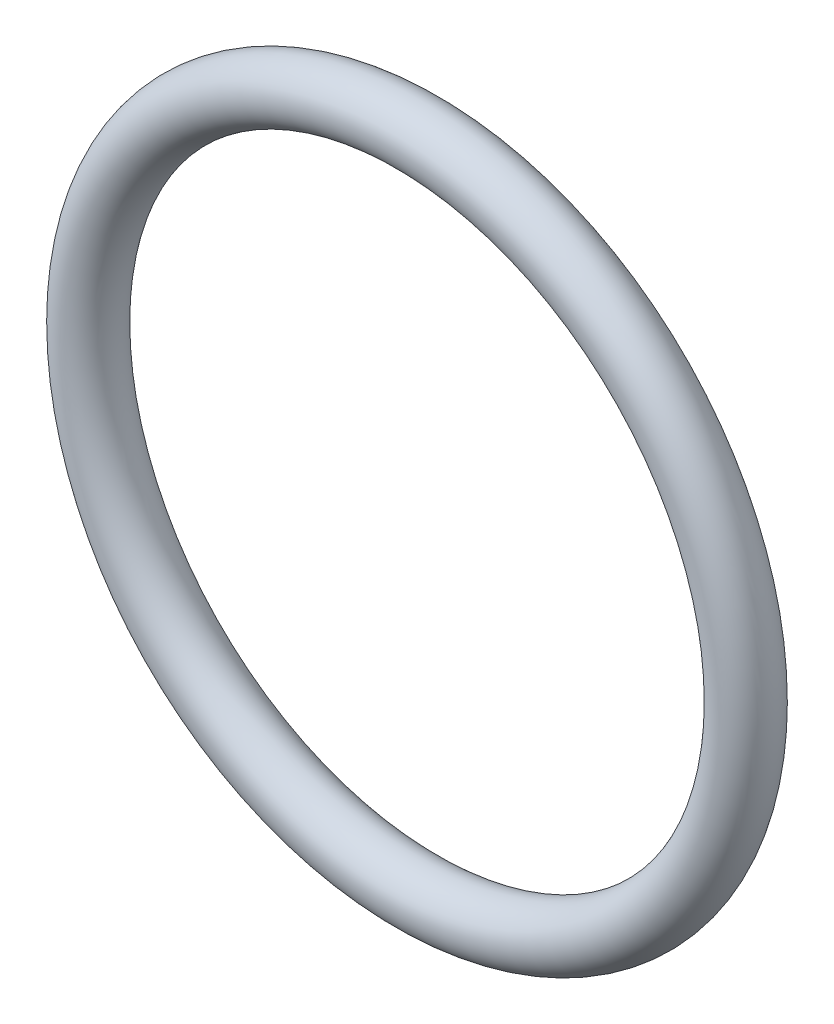
ISO-10303-21;
HEADER;
FILE_DESCRIPTION(('STEP AP214'),'2;1');
FILE_NAME('part.step','',(''),(''),'','','');
FILE_SCHEMA(('AUTOMOTIVE_DESIGN { 1 0 10303 214 1 1 1 1 }'));
ENDSEC;
DATA;
#1=APPLICATION_CONTEXT('core data for automotive mechanical design processes');
#2=APPLICATION_PROTOCOL_DEFINITION('international standard','automotive_design',2000,#1);
#3=PRODUCT_CONTEXT('',#1,'mechanical');
#4=PRODUCT('Part','Part','',(#3));
#5=PRODUCT_RELATED_PRODUCT_CATEGORY('part','',(#4));
#6=PRODUCT_DEFINITION_FORMATION('','',#4);
#7=PRODUCT_DEFINITION_CONTEXT('part definition',#1,'design');
#8=PRODUCT_DEFINITION('design','',#6,#7);
#9=PRODUCT_DEFINITION_SHAPE('','',#8);
#10=(LENGTH_UNIT() NAMED_UNIT(*) SI_UNIT(.MILLI.,.METRE.));
#11=(NAMED_UNIT(*) PLANE_ANGLE_UNIT() SI_UNIT($,.RADIAN.));
#12=(NAMED_UNIT(*) SI_UNIT($,.STERADIAN.) SOLID_ANGLE_UNIT());
#13=UNCERTAINTY_MEASURE_WITH_UNIT(LENGTH_MEASURE(1.E-05),#10,'distance_accuracy_value','');
#14=(GEOMETRIC_REPRESENTATION_CONTEXT(3) GLOBAL_UNCERTAINTY_ASSIGNED_CONTEXT((#13)) GLOBAL_UNIT_ASSIGNED_CONTEXT((#10,
#11,#12)) REPRESENTATION_CONTEXT('',''));
#15=CARTESIAN_POINT('',(0.,0.,0.));
#16=DIRECTION('',(0.,0.,1.));
#17=DIRECTION('',(1.,0.,0.));
#18=AXIS2_PLACEMENT_3D('',#15,#16,#17);
#19=CARTESIAN_POINT('',(0.,0.,0.));
#20=DIRECTION('',(0.,0.,1.));
#21=DIRECTION('',(1.,0.,0.));
#22=AXIS2_PLACEMENT_3D('',#19,#20,#21);
#23=TOROIDAL_SURFACE('',#22,14.6304,1.3081);
#24=CARTESIAN_POINT('',(15.9385,0.,0.));
#25=VERTEX_POINT('',#24);
#26=VERTEX_LOOP('',#25);
#27=FACE_BOUND('',#26,.T.);
#28=ADVANCED_FACE('F42',(#27),#23,.T.);
#29=CLOSED_SHELL('',(#28));
#30=MANIFOLD_SOLID_BREP('B2',#29);
#31=ADVANCED_BREP_SHAPE_REPRESENTATION('',(#18,#30),#14);
#32=SHAPE_DEFINITION_REPRESENTATION(#9,#31);
ENDSEC;
END-ISO-10303-21;
